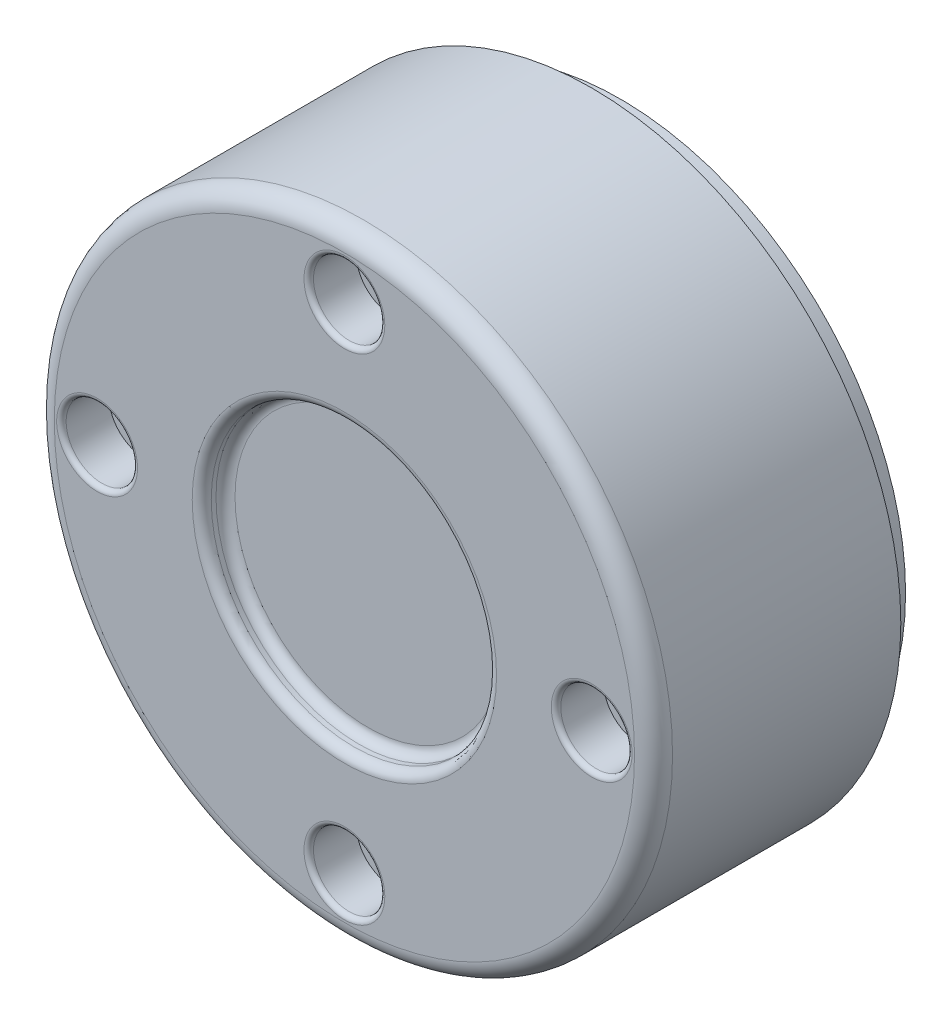
ISO-10303-21;
HEADER;
FILE_DESCRIPTION(('STEP AP214'),'2;1');
FILE_NAME('part.step','',(''),(''),'','','');
FILE_SCHEMA(('AUTOMOTIVE_DESIGN { 1 0 10303 214 1 1 1 1 }'));
ENDSEC;
DATA;
#1=APPLICATION_CONTEXT('core data for automotive mechanical design processes');
#2=APPLICATION_PROTOCOL_DEFINITION('international standard','automotive_design',2000,#1);
#3=PRODUCT_CONTEXT('',#1,'mechanical');
#4=PRODUCT('Part','Part','',(#3));
#5=PRODUCT_RELATED_PRODUCT_CATEGORY('part','',(#4));
#6=PRODUCT_DEFINITION_FORMATION('','',#4);
#7=PRODUCT_DEFINITION_CONTEXT('part definition',#1,'design');
#8=PRODUCT_DEFINITION('design','',#6,#7);
#9=PRODUCT_DEFINITION_SHAPE('','',#8);
#10=(LENGTH_UNIT() NAMED_UNIT(*) SI_UNIT(.MILLI.,.METRE.));
#11=(NAMED_UNIT(*) PLANE_ANGLE_UNIT() SI_UNIT($,.RADIAN.));
#12=(NAMED_UNIT(*) SI_UNIT($,.STERADIAN.) SOLID_ANGLE_UNIT());
#13=UNCERTAINTY_MEASURE_WITH_UNIT(LENGTH_MEASURE(1.E-05),#10,'distance_accuracy_value','');
#14=(GEOMETRIC_REPRESENTATION_CONTEXT(3) GLOBAL_UNCERTAINTY_ASSIGNED_CONTEXT((#13)) GLOBAL_UNIT_ASSIGNED_CONTEXT((#10,
#11,#12)) REPRESENTATION_CONTEXT('',''));
#15=CARTESIAN_POINT('',(0.,0.,0.));
#16=DIRECTION('',(0.,0.,1.));
#17=DIRECTION('',(1.,0.,0.));
#18=AXIS2_PLACEMENT_3D('',#15,#16,#17);
#19=CARTESIAN_POINT('',(0.,0.,3.));
#20=DIRECTION('',(0.,0.,-1.));
#21=DIRECTION('',(-1.,0.,0.));
#22=AXIS2_PLACEMENT_3D('',#19,#20,#21);
#23=CYLINDRICAL_SURFACE('',#22,30.);
#24=CARTESIAN_POINT('',(0.,0.,3.));
#25=DIRECTION('',(0.,0.,1.));
#26=DIRECTION('',(1.,0.,0.));
#27=AXIS2_PLACEMENT_3D('',#24,#25,#26);
#28=CIRCLE('',#27,30.);
#29=CARTESIAN_POINT('',(30.,0.,3.));
#30=VERTEX_POINT('',#29);
#31=EDGE_CURVE('E178',#30,#30,#28,.T.);
#32=ORIENTED_EDGE('',*,*,#31,.F.);
#33=EDGE_LOOP('',(#32));
#34=FACE_BOUND('',#33,.T.);
#35=CARTESIAN_POINT('',(0.,0.,0.));
#36=DIRECTION('',(0.,0.,1.));
#37=DIRECTION('',(1.,0.,0.));
#38=AXIS2_PLACEMENT_3D('',#35,#36,#37);
#39=CIRCLE('',#38,30.);
#40=CARTESIAN_POINT('',(30.,0.,0.));
#41=VERTEX_POINT('',#40);
#42=EDGE_CURVE('E177',#41,#41,#39,.T.);
#43=ORIENTED_EDGE('',*,*,#42,.T.);
#44=EDGE_LOOP('',(#43));
#45=FACE_BOUND('',#44,.T.);
#46=ADVANCED_FACE('F43',(#34,#45),#23,.T.);
#47=CARTESIAN_POINT('',(0.,0.,0.));
#48=DIRECTION('',(0.,0.,1.));
#49=DIRECTION('',(1.,0.,0.));
#50=AXIS2_PLACEMENT_3D('',#47,#48,#49);
#51=PLANE('',#50);
#52=CARTESIAN_POINT('',(0.,0.,0.));
#53=DIRECTION('',(0.,0.,1.));
#54=DIRECTION('',(1.,0.,0.));
#55=AXIS2_PLACEMENT_3D('',#52,#53,#54);
#56=CIRCLE('',#55,27.5);
#57=CARTESIAN_POINT('',(27.5,0.,0.));
#58=VERTEX_POINT('',#57);
#59=EDGE_CURVE('E617',#58,#58,#56,.T.);
#60=ORIENTED_EDGE('',*,*,#59,.T.);
#61=EDGE_LOOP('',(#60));
#62=FACE_BOUND('',#61,.T.);
#63=ORIENTED_EDGE('',*,*,#42,.F.);
#64=EDGE_LOOP('',(#63));
#65=FACE_BOUND('',#64,.T.);
#66=ADVANCED_FACE('F253',(#62,#65),#51,.F.);
#67=CARTESIAN_POINT('',(0.,0.,29.));
#68=DIRECTION('',(0.,0.,-1.));
#69=DIRECTION('',(-1.,0.,0.));
#70=AXIS2_PLACEMENT_3D('',#67,#68,#69);
#71=CYLINDRICAL_SURFACE('',#70,32.5);
#72=CARTESIAN_POINT('',(0.,0.,27.));
#73=DIRECTION('',(0.,0.,1.));
#74=DIRECTION('',(1.,0.,0.));
#75=AXIS2_PLACEMENT_3D('',#72,#73,#74);
#76=CIRCLE('',#75,32.5);
#77=CARTESIAN_POINT('',(-32.5,0.,27.));
#78=VERTEX_POINT('',#77);
#79=EDGE_CURVE('E205',#78,#78,#76,.F.);
#80=CARTESIAN_POINT('',(0.,0.,3.));
#81=DIRECTION('',(0.,0.,1.));
#82=DIRECTION('',(1.,0.,0.));
#83=AXIS2_PLACEMENT_3D('',#80,#81,#82);
#84=CIRCLE('',#83,32.5);
#85=CARTESIAN_POINT('',(-32.5,0.,3.));
#86=VERTEX_POINT('',#85);
#87=EDGE_CURVE('E173',#86,#86,#84,.T.);
#88=CARTESIAN_POINT('',(-32.5,0.,27.));
#89=CARTESIAN_POINT('',(-32.5,0.,26.75));
#90=CARTESIAN_POINT('',(-32.5,0.,26.5));
#91=CARTESIAN_POINT('',(-32.5,0.,26.));
#92=CARTESIAN_POINT('',(-32.5,0.,25.75));
#93=CARTESIAN_POINT('',(-32.5,0.,25.25));
#94=CARTESIAN_POINT('',(-32.5,0.,25.));
#95=CARTESIAN_POINT('',(-32.5,0.,24.5));
#96=CARTESIAN_POINT('',(-32.5,0.,24.25));
#97=CARTESIAN_POINT('',(-32.5,0.,23.75));
#98=CARTESIAN_POINT('',(-32.5,0.,23.5));
#99=CARTESIAN_POINT('',(-32.5,0.,23.));
#100=CARTESIAN_POINT('',(-32.5,0.,22.75));
#101=CARTESIAN_POINT('',(-32.5,0.,22.25));
#102=CARTESIAN_POINT('',(-32.5,0.,22.));
#103=CARTESIAN_POINT('',(-32.5,0.,21.5));
#104=CARTESIAN_POINT('',(-32.5,0.,21.25));
#105=CARTESIAN_POINT('',(-32.5,0.,20.75));
#106=CARTESIAN_POINT('',(-32.5,0.,20.5));
#107=CARTESIAN_POINT('',(-32.5,0.,20.));
#108=CARTESIAN_POINT('',(-32.5,0.,19.75));
#109=CARTESIAN_POINT('',(-32.5,0.,19.25));
#110=CARTESIAN_POINT('',(-32.5,0.,19.));
#111=CARTESIAN_POINT('',(-32.5,0.,18.5));
#112=CARTESIAN_POINT('',(-32.5,0.,18.25));
#113=CARTESIAN_POINT('',(-32.5,0.,17.75));
#114=CARTESIAN_POINT('',(-32.5,0.,17.5));
#115=CARTESIAN_POINT('',(-32.5,0.,17.));
#116=CARTESIAN_POINT('',(-32.5,0.,16.75));
#117=CARTESIAN_POINT('',(-32.5,0.,16.25));
#118=CARTESIAN_POINT('',(-32.5,0.,16.));
#119=CARTESIAN_POINT('',(-32.5,0.,15.5));
#120=CARTESIAN_POINT('',(-32.5,0.,15.25));
#121=CARTESIAN_POINT('',(-32.5,0.,14.75));
#122=CARTESIAN_POINT('',(-32.5,0.,14.5));
#123=CARTESIAN_POINT('',(-32.5,0.,14.));
#124=CARTESIAN_POINT('',(-32.5,0.,13.75));
#125=CARTESIAN_POINT('',(-32.5,0.,13.25));
#126=CARTESIAN_POINT('',(-32.5,0.,13.));
#127=CARTESIAN_POINT('',(-32.5,0.,12.5));
#128=CARTESIAN_POINT('',(-32.5,0.,12.25));
#129=CARTESIAN_POINT('',(-32.5,0.,11.75));
#130=CARTESIAN_POINT('',(-32.5,0.,11.5));
#131=CARTESIAN_POINT('',(-32.5,0.,11.));
#132=CARTESIAN_POINT('',(-32.5,0.,10.75));
#133=CARTESIAN_POINT('',(-32.5,0.,10.25));
#134=CARTESIAN_POINT('',(-32.5,0.,10.));
#135=CARTESIAN_POINT('',(-32.5,0.,9.5));
#136=CARTESIAN_POINT('',(-32.5,0.,9.25));
#137=CARTESIAN_POINT('',(-32.5,0.,8.75));
#138=CARTESIAN_POINT('',(-32.5,0.,8.5));
#139=CARTESIAN_POINT('',(-32.5,0.,8.));
#140=CARTESIAN_POINT('',(-32.5,0.,7.75));
#141=CARTESIAN_POINT('',(-32.5,0.,7.25));
#142=CARTESIAN_POINT('',(-32.5,0.,7.));
#143=CARTESIAN_POINT('',(-32.5,0.,6.5));
#144=CARTESIAN_POINT('',(-32.5,0.,6.25));
#145=CARTESIAN_POINT('',(-32.5,0.,5.75));
#146=CARTESIAN_POINT('',(-32.5,0.,5.5));
#147=CARTESIAN_POINT('',(-32.5,0.,5.));
#148=CARTESIAN_POINT('',(-32.5,0.,4.75));
#149=CARTESIAN_POINT('',(-32.5,0.,4.25));
#150=CARTESIAN_POINT('',(-32.5,0.,4.));
#151=CARTESIAN_POINT('',(-32.5,0.,3.5));
#152=CARTESIAN_POINT('',(-32.5,0.,3.25));
#153=CARTESIAN_POINT('',(-32.5,0.,3.));
#154=B_SPLINE_CURVE_WITH_KNOTS('',3,(#88,#89,#90,#91,#92,#93,#94,#95,#96,#97,#98,#99,#100,#101,
#102,#103,#104,#105,#106,#107,#108,#109,#110,#111,#112,#113,#114,#115,#116,#117,#118,#119,#120,
#121,#122,#123,#124,#125,#126,#127,#128,#129,#130,#131,#132,#133,#134,#135,#136,#137,#138,#139,
#140,#141,#142,#143,#144,#145,#146,#147,#148,#149,#150,#151,#152,#153),.UNSPECIFIED.,.F.,.F.,(4,
2,2,2,2,2,2,2,2,2,2,2,2,2,2,2,2,2,2,2,2,2,2,2,2,2,2,2,2,2,2,2,4),(0.,0.749999999999997,1.5,2.25,
3.,3.75,4.5,5.25,5.99999999999999,6.75,7.5,8.25,9.,9.75,10.5,11.25,12.,12.75,13.5,14.25,15.,
15.75,16.5,17.25,18.,18.75,19.5,20.25,21.,21.75,22.5,23.25,24.),.UNSPECIFIED.);
#155=EDGE_CURVE('BSEAM259',#78,#86,#154,.T.);
#156=ORIENTED_EDGE('',*,*,#79,.T.);
#157=ORIENTED_EDGE('',*,*,#87,.T.);
#158=ORIENTED_EDGE('',*,*,#155,.T.);
#159=ORIENTED_EDGE('',*,*,#155,.F.);
#160=EDGE_LOOP('',(#156,#158,#157,#159));
#161=FACE_BOUND('',#160,.T.);
#162=ADVANCED_FACE('F259',(#161),#71,.T.);
#163=CARTESIAN_POINT('',(0.,0.,29.));
#164=DIRECTION('',(0.,0.,1.));
#165=DIRECTION('',(1.,0.,0.));
#166=AXIS2_PLACEMENT_3D('',#163,#164,#165);
#167=PLANE('',#166);
#168=CARTESIAN_POINT('',(26.,0.,29.));
#169=DIRECTION('',(0.,0.,1.));
#170=DIRECTION('',(1.,0.,0.));
#171=AXIS2_PLACEMENT_3D('',#168,#169,#170);
#172=CIRCLE('',#171,4.25);
#173=CARTESIAN_POINT('',(30.25,0.,29.));
#174=VERTEX_POINT('',#173);
#175=EDGE_CURVE('E225',#174,#174,#172,.F.);
#176=ORIENTED_EDGE('',*,*,#175,.T.);
#177=EDGE_LOOP('',(#176));
#178=FACE_BOUND('',#177,.T.);
#179=CARTESIAN_POINT('',(0.,26.,29.));
#180=DIRECTION('',(0.,0.,1.));
#181=DIRECTION('',(1.,0.,0.));
#182=AXIS2_PLACEMENT_3D('',#179,#180,#181);
#183=CIRCLE('',#182,4.25);
#184=CARTESIAN_POINT('',(4.25,26.,29.));
#185=VERTEX_POINT('',#184);
#186=EDGE_CURVE('E221',#185,#185,#183,.F.);
#187=ORIENTED_EDGE('',*,*,#186,.T.);
#188=EDGE_LOOP('',(#187));
#189=FACE_BOUND('',#188,.T.);
#190=CARTESIAN_POINT('',(-26.,0.,29.));
#191=DIRECTION('',(0.,0.,1.));
#192=DIRECTION('',(1.,0.,0.));
#193=AXIS2_PLACEMENT_3D('',#190,#191,#192);
#194=CIRCLE('',#193,4.25);
#195=CARTESIAN_POINT('',(-21.75,0.,29.));
#196=VERTEX_POINT('',#195);
#197=EDGE_CURVE('E217',#196,#196,#194,.F.);
#198=ORIENTED_EDGE('',*,*,#197,.T.);
#199=EDGE_LOOP('',(#198));
#200=FACE_BOUND('',#199,.T.);
#201=CARTESIAN_POINT('',(0.,-26.,29.));
#202=DIRECTION('',(0.,0.,1.));
#203=DIRECTION('',(1.,0.,0.));
#204=AXIS2_PLACEMENT_3D('',#201,#202,#203);
#205=CIRCLE('',#204,4.25000000000001);
#206=CARTESIAN_POINT('',(4.25000000000001,-26.,29.));
#207=VERTEX_POINT('',#206);
#208=EDGE_CURVE('E213',#207,#207,#205,.F.);
#209=ORIENTED_EDGE('',*,*,#208,.T.);
#210=EDGE_LOOP('',(#209));
#211=FACE_BOUND('',#210,.T.);
#212=CARTESIAN_POINT('',(0.,0.,29.));
#213=DIRECTION('',(0.,0.,1.));
#214=DIRECTION('',(1.,0.,0.));
#215=AXIS2_PLACEMENT_3D('',#212,#213,#214);
#216=CIRCLE('',#215,30.5);
#217=CARTESIAN_POINT('',(30.5,0.,29.));
#218=VERTEX_POINT('',#217);
#219=EDGE_CURVE('E201',#218,#218,#216,.T.);
#220=ORIENTED_EDGE('',*,*,#219,.T.);
#221=EDGE_LOOP('',(#220));
#222=FACE_BOUND('',#221,.T.);
#223=CARTESIAN_POINT('',(0.,0.,29.));
#224=DIRECTION('',(0.,0.,1.));
#225=DIRECTION('',(1.,0.,0.));
#226=AXIS2_PLACEMENT_3D('',#223,#224,#225);
#227=CIRCLE('',#226,16.);
#228=CARTESIAN_POINT('',(16.,0.,29.));
#229=VERTEX_POINT('',#228);
#230=EDGE_CURVE('E197',#229,#229,#227,.F.);
#231=ORIENTED_EDGE('',*,*,#230,.T.);
#232=EDGE_LOOP('',(#231));
#233=FACE_BOUND('',#232,.T.);
#234=ADVANCED_FACE('F327',(#178,#189,#200,#211,#222,#233),#167,.T.);
#235=CARTESIAN_POINT('',(0.,0.,3.));
#236=DIRECTION('',(0.,0.,1.));
#237=DIRECTION('',(1.,0.,0.));
#238=AXIS2_PLACEMENT_3D('',#235,#236,#237);
#239=PLANE('',#238);
#240=ORIENTED_EDGE('',*,*,#31,.T.);
#241=EDGE_LOOP('',(#240));
#242=FACE_BOUND('',#241,.T.);
#243=ORIENTED_EDGE('',*,*,#87,.F.);
#244=EDGE_LOOP('',(#243));
#245=FACE_BOUND('',#244,.T.);
#246=ADVANCED_FACE('F325',(#242,#245),#239,.F.);
#247=CARTESIAN_POINT('',(0.,0.,26.5));
#248=DIRECTION('',(0.,0.,1.));
#249=DIRECTION('',(1.,0.,0.));
#250=AXIS2_PLACEMENT_3D('',#247,#248,#249);
#251=CYLINDRICAL_SURFACE('',#250,15.);
#252=CARTESIAN_POINT('',(0.,0.,28.));
#253=DIRECTION('',(0.,0.,1.));
#254=DIRECTION('',(1.,0.,0.));
#255=AXIS2_PLACEMENT_3D('',#252,#253,#254);
#256=CIRCLE('',#255,15.);
#257=CARTESIAN_POINT('',(15.,0.,28.));
#258=VERTEX_POINT('',#257);
#259=EDGE_CURVE('E193',#258,#258,#256,.T.);
#260=ORIENTED_EDGE('',*,*,#259,.T.);
#261=EDGE_LOOP('',(#260));
#262=FACE_BOUND('',#261,.T.);
#263=CARTESIAN_POINT('',(0.,0.,27.5));
#264=DIRECTION('',(0.,0.,1.));
#265=DIRECTION('',(1.,0.,0.));
#266=AXIS2_PLACEMENT_3D('',#263,#264,#265);
#267=CIRCLE('',#266,15.);
#268=CARTESIAN_POINT('',(15.,0.,27.5));
#269=VERTEX_POINT('',#268);
#270=EDGE_CURVE('E189',#269,#269,#267,.F.);
#271=ORIENTED_EDGE('',*,*,#270,.T.);
#272=EDGE_LOOP('',(#271));
#273=FACE_BOUND('',#272,.T.);
#274=ADVANCED_FACE('F321',(#262,#273),#251,.F.);
#275=CARTESIAN_POINT('',(0.,0.,26.5));
#276=DIRECTION('',(0.,0.,1.));
#277=DIRECTION('',(1.,0.,0.));
#278=AXIS2_PLACEMENT_3D('',#275,#276,#277);
#279=PLANE('',#278);
#280=CARTESIAN_POINT('',(0.,0.,26.5));
#281=DIRECTION('',(0.,0.,1.));
#282=DIRECTION('',(1.,0.,0.));
#283=AXIS2_PLACEMENT_3D('',#280,#281,#282);
#284=CIRCLE('',#283,14.);
#285=CARTESIAN_POINT('',(14.,0.,26.5));
#286=VERTEX_POINT('',#285);
#287=EDGE_CURVE('E182',#286,#286,#284,.T.);
#288=ORIENTED_EDGE('',*,*,#287,.T.);
#289=EDGE_LOOP('',(#288));
#290=FACE_BOUND('',#289,.T.);
#291=ADVANCED_FACE('F318',(#290),#279,.T.);
#292=CARTESIAN_POINT('',(-26.,0.,24.));
#293=DIRECTION('',(0.,0.,1.));
#294=DIRECTION('',(1.,0.,0.));
#295=AXIS2_PLACEMENT_3D('',#292,#293,#294);
#296=CYLINDRICAL_SURFACE('',#295,3.75);
#297=CARTESIAN_POINT('',(-26.,0.,28.5));
#298=DIRECTION('',(0.,0.,1.));
#299=DIRECTION('',(1.,0.,0.));
#300=AXIS2_PLACEMENT_3D('',#297,#298,#299);
#301=CIRCLE('',#300,3.75);
#302=CARTESIAN_POINT('',(-22.25,0.,28.5));
#303=VERTEX_POINT('',#302);
#304=EDGE_CURVE('E52',#303,#303,#301,.T.);
#305=ORIENTED_EDGE('',*,*,#304,.T.);
#306=EDGE_LOOP('',(#305));
#307=FACE_BOUND('',#306,.T.);
#308=CARTESIAN_POINT('',(-26.,0.,24.));
#309=DIRECTION('',(0.,0.,1.));
#310=DIRECTION('',(1.,0.,0.));
#311=AXIS2_PLACEMENT_3D('',#308,#309,#310);
#312=CIRCLE('',#311,3.75);
#313=CARTESIAN_POINT('',(-22.25,0.,24.));
#314=VERTEX_POINT('',#313);
#315=EDGE_CURVE('E161',#314,#314,#312,.T.);
#316=ORIENTED_EDGE('',*,*,#315,.F.);
#317=EDGE_LOOP('',(#316));
#318=FACE_BOUND('',#317,.T.);
#319=ADVANCED_FACE('F236',(#307,#318),#296,.F.);
#320=CARTESIAN_POINT('',(0.,0.,24.));
#321=DIRECTION('',(0.,0.,1.));
#322=DIRECTION('',(1.,0.,0.));
#323=AXIS2_PLACEMENT_3D('',#320,#321,#322);
#324=PLANE('',#323);
#325=ORIENTED_EDGE('',*,*,#315,.T.);
#326=EDGE_LOOP('',(#325));
#327=FACE_BOUND('',#326,.T.);
#328=ADVANCED_FACE('F308',(#327),#324,.T.);
#329=CARTESIAN_POINT('',(0.,-26.,24.));
#330=DIRECTION('',(0.,0.,1.));
#331=DIRECTION('',(1.,0.,0.));
#332=AXIS2_PLACEMENT_3D('',#329,#330,#331);
#333=CYLINDRICAL_SURFACE('',#332,3.75000000000001);
#334=CARTESIAN_POINT('',(0.,-26.,28.5));
#335=DIRECTION('',(0.,0.,1.));
#336=DIRECTION('',(1.,0.,0.));
#337=AXIS2_PLACEMENT_3D('',#334,#335,#336);
#338=CIRCLE('',#337,3.75000000000001);
#339=CARTESIAN_POINT('',(3.75000000000001,-26.,28.5));
#340=VERTEX_POINT('',#339);
#341=EDGE_CURVE('E13',#340,#340,#338,.T.);
#342=ORIENTED_EDGE('',*,*,#341,.T.);
#343=EDGE_LOOP('',(#342));
#344=FACE_BOUND('',#343,.T.);
#345=CARTESIAN_POINT('',(0.,-26.,24.));
#346=DIRECTION('',(0.,0.,1.));
#347=DIRECTION('',(1.,0.,0.));
#348=AXIS2_PLACEMENT_3D('',#345,#346,#347);
#349=CIRCLE('',#348,3.75000000000001);
#350=CARTESIAN_POINT('',(3.75000000000001,-26.,24.));
#351=VERTEX_POINT('',#350);
#352=EDGE_CURVE('E166',#351,#351,#349,.T.);
#353=ORIENTED_EDGE('',*,*,#352,.F.);
#354=EDGE_LOOP('',(#353));
#355=FACE_BOUND('',#354,.T.);
#356=ADVANCED_FACE('F305',(#344,#355),#333,.F.);
#357=CARTESIAN_POINT('',(0.,-26.,24.));
#358=DIRECTION('',(0.,0.,1.));
#359=DIRECTION('',(1.,0.,0.));
#360=AXIS2_PLACEMENT_3D('',#357,#358,#359);
#361=PLANE('',#360);
#362=ORIENTED_EDGE('',*,*,#352,.T.);
#363=EDGE_LOOP('',(#362));
#364=FACE_BOUND('',#363,.T.);
#365=ADVANCED_FACE('F291',(#364),#361,.T.);
#366=CARTESIAN_POINT('',(26.,0.,24.));
#367=DIRECTION('',(0.,0.,1.));
#368=DIRECTION('',(1.,0.,0.));
#369=AXIS2_PLACEMENT_3D('',#366,#367,#368);
#370=CYLINDRICAL_SURFACE('',#369,3.75);
#371=CARTESIAN_POINT('',(26.,0.,28.5));
#372=DIRECTION('',(0.,0.,1.));
#373=DIRECTION('',(1.,0.,0.));
#374=AXIS2_PLACEMENT_3D('',#371,#372,#373);
#375=CIRCLE('',#374,3.75);
#376=CARTESIAN_POINT('',(29.75,0.,28.5));
#377=VERTEX_POINT('',#376);
#378=EDGE_CURVE('E209',#377,#377,#375,.T.);
#379=ORIENTED_EDGE('',*,*,#378,.T.);
#380=EDGE_LOOP('',(#379));
#381=FACE_BOUND('',#380,.T.);
#382=CARTESIAN_POINT('',(26.,0.,24.));
#383=DIRECTION('',(0.,0.,1.));
#384=DIRECTION('',(1.,0.,0.));
#385=AXIS2_PLACEMENT_3D('',#382,#383,#384);
#386=CIRCLE('',#385,3.75);
#387=CARTESIAN_POINT('',(29.75,0.,24.));
#388=VERTEX_POINT('',#387);
#389=EDGE_CURVE('E162',#388,#388,#386,.T.);
#390=ORIENTED_EDGE('',*,*,#389,.F.);
#391=EDGE_LOOP('',(#390));
#392=FACE_BOUND('',#391,.T.);
#393=ADVANCED_FACE('F287',(#381,#392),#370,.F.);
#394=CARTESIAN_POINT('',(0.,0.,24.));
#395=DIRECTION('',(0.,0.,1.));
#396=DIRECTION('',(1.,0.,0.));
#397=AXIS2_PLACEMENT_3D('',#394,#395,#396);
#398=PLANE('',#397);
#399=ORIENTED_EDGE('',*,*,#389,.T.);
#400=EDGE_LOOP('',(#399));
#401=FACE_BOUND('',#400,.T.);
#402=ADVANCED_FACE('F290',(#401),#398,.T.);
#403=CARTESIAN_POINT('',(0.,26.,24.));
#404=DIRECTION('',(0.,0.,1.));
#405=DIRECTION('',(1.,0.,0.));
#406=AXIS2_PLACEMENT_3D('',#403,#404,#405);
#407=CYLINDRICAL_SURFACE('',#406,3.75);
#408=CARTESIAN_POINT('',(0.,26.,28.5));
#409=DIRECTION('',(0.,0.,1.));
#410=DIRECTION('',(1.,0.,0.));
#411=AXIS2_PLACEMENT_3D('',#408,#409,#410);
#412=CIRCLE('',#411,3.75);
#413=CARTESIAN_POINT('',(3.75,26.,28.5));
#414=VERTEX_POINT('',#413);
#415=EDGE_CURVE('E229',#414,#414,#412,.T.);
#416=ORIENTED_EDGE('',*,*,#415,.T.);
#417=EDGE_LOOP('',(#416));
#418=FACE_BOUND('',#417,.T.);
#419=CARTESIAN_POINT('',(0.,26.,24.));
#420=DIRECTION('',(0.,0.,1.));
#421=DIRECTION('',(1.,0.,0.));
#422=AXIS2_PLACEMENT_3D('',#419,#420,#421);
#423=CIRCLE('',#422,3.75);
#424=CARTESIAN_POINT('',(3.75,26.,24.));
#425=VERTEX_POINT('',#424);
#426=EDGE_CURVE('E157',#425,#425,#423,.T.);
#427=ORIENTED_EDGE('',*,*,#426,.F.);
#428=EDGE_LOOP('',(#427));
#429=FACE_BOUND('',#428,.T.);
#430=ADVANCED_FACE('F296',(#418,#429),#407,.F.);
#431=CARTESIAN_POINT('',(0.,0.,24.));
#432=DIRECTION('',(0.,0.,1.));
#433=DIRECTION('',(1.,0.,0.));
#434=AXIS2_PLACEMENT_3D('',#431,#432,#433);
#435=PLANE('',#434);
#436=ORIENTED_EDGE('',*,*,#426,.T.);
#437=EDGE_LOOP('',(#436));
#438=FACE_BOUND('',#437,.T.);
#439=ADVANCED_FACE('F270',(#438),#435,.T.);
#440=CARTESIAN_POINT('',(0.,0.,27.5));
#441=DIRECTION('',(0.,0.,1.));
#442=DIRECTION('',(1.,0.,0.));
#443=AXIS2_PLACEMENT_3D('',#440,#441,#442);
#444=TOROIDAL_SURFACE('',#443,14.,1.);
#445=ORIENTED_EDGE('',*,*,#270,.F.);
#446=EDGE_LOOP('',(#445));
#447=FACE_BOUND('',#446,.T.);
#448=ORIENTED_EDGE('',*,*,#287,.F.);
#449=EDGE_LOOP('',(#448));
#450=FACE_BOUND('',#449,.T.);
#451=ADVANCED_FACE('F266',(#447,#450),#444,.F.);
#452=CARTESIAN_POINT('',(0.,0.,28.));
#453=DIRECTION('',(0.,0.,1.));
#454=DIRECTION('',(1.,0.,0.));
#455=AXIS2_PLACEMENT_3D('',#452,#453,#454);
#456=TOROIDAL_SURFACE('',#455,16.,1.);
#457=ORIENTED_EDGE('',*,*,#230,.F.);
#458=EDGE_LOOP('',(#457));
#459=FACE_BOUND('',#458,.T.);
#460=ORIENTED_EDGE('',*,*,#259,.F.);
#461=EDGE_LOOP('',(#460));
#462=FACE_BOUND('',#461,.T.);
#463=ADVANCED_FACE('F269',(#459,#462),#456,.T.);
#464=CARTESIAN_POINT('',(0.,0.,27.));
#465=DIRECTION('',(0.,0.,1.));
#466=DIRECTION('',(1.,0.,0.));
#467=AXIS2_PLACEMENT_3D('',#464,#465,#466);
#468=TOROIDAL_SURFACE('',#467,30.5,2.);
#469=ORIENTED_EDGE('',*,*,#79,.F.);
#470=EDGE_LOOP('',(#469));
#471=FACE_BOUND('',#470,.T.);
#472=ORIENTED_EDGE('',*,*,#219,.F.);
#473=EDGE_LOOP('',(#472));
#474=FACE_BOUND('',#473,.T.);
#475=ADVANCED_FACE('F274',(#471,#474),#468,.T.);
#476=CARTESIAN_POINT('',(26.,0.,28.5));
#477=DIRECTION('',(0.,0.,1.));
#478=DIRECTION('',(1.,0.,0.));
#479=AXIS2_PLACEMENT_3D('',#476,#477,#478);
#480=TOROIDAL_SURFACE('',#479,4.25,0.5);
#481=ORIENTED_EDGE('',*,*,#175,.F.);
#482=EDGE_LOOP('',(#481));
#483=FACE_BOUND('',#482,.T.);
#484=ORIENTED_EDGE('',*,*,#378,.F.);
#485=EDGE_LOOP('',(#484));
#486=FACE_BOUND('',#485,.T.);
#487=ADVANCED_FACE('F248',(#483,#486),#480,.T.);
#488=CARTESIAN_POINT('',(0.,26.,28.5));
#489=DIRECTION('',(0.,0.,1.));
#490=DIRECTION('',(1.,0.,0.));
#491=AXIS2_PLACEMENT_3D('',#488,#489,#490);
#492=TOROIDAL_SURFACE('',#491,4.25,0.5);
#493=ORIENTED_EDGE('',*,*,#186,.F.);
#494=EDGE_LOOP('',(#493));
#495=FACE_BOUND('',#494,.T.);
#496=ORIENTED_EDGE('',*,*,#415,.F.);
#497=EDGE_LOOP('',(#496));
#498=FACE_BOUND('',#497,.T.);
#499=ADVANCED_FACE('F241',(#495,#498),#492,.T.);
#500=CARTESIAN_POINT('',(-26.,0.,28.5));
#501=DIRECTION('',(0.,0.,1.));
#502=DIRECTION('',(1.,0.,0.));
#503=AXIS2_PLACEMENT_3D('',#500,#501,#502);
#504=TOROIDAL_SURFACE('',#503,4.25,0.5);
#505=ORIENTED_EDGE('',*,*,#197,.F.);
#506=EDGE_LOOP('',(#505));
#507=FACE_BOUND('',#506,.T.);
#508=ORIENTED_EDGE('',*,*,#304,.F.);
#509=EDGE_LOOP('',(#508));
#510=FACE_BOUND('',#509,.T.);
#511=ADVANCED_FACE('F239',(#507,#510),#504,.T.);
#512=CARTESIAN_POINT('',(0.,-26.,28.5));
#513=DIRECTION('',(0.,0.,1.));
#514=DIRECTION('',(1.,0.,0.));
#515=AXIS2_PLACEMENT_3D('',#512,#513,#514);
#516=TOROIDAL_SURFACE('',#515,4.25000000000001,0.5);
#517=ORIENTED_EDGE('',*,*,#208,.F.);
#518=EDGE_LOOP('',(#517));
#519=FACE_BOUND('',#518,.T.);
#520=ORIENTED_EDGE('',*,*,#341,.F.);
#521=EDGE_LOOP('',(#520));
#522=FACE_BOUND('',#521,.T.);
#523=ADVANCED_FACE('F45',(#519,#522),#516,.T.);
#524=CARTESIAN_POINT('',(0.,0.,29.));
#525=DIRECTION('',(0.,0.,-1.));
#526=DIRECTION('',(-1.,0.,0.));
#527=AXIS2_PLACEMENT_3D('',#524,#525,#526);
#528=CYLINDRICAL_SURFACE('',#527,30.);
#529=CARTESIAN_POINT('',(0.,0.,5.5));
#530=DIRECTION('',(0.,0.,1.));
#531=DIRECTION('',(1.,0.,0.));
#532=AXIS2_PLACEMENT_3D('',#529,#530,#531);
#533=CIRCLE('',#532,30.);
#534=CARTESIAN_POINT('',(30.,0.,5.5));
#535=VERTEX_POINT('',#534);
#536=EDGE_CURVE('E611',#535,#535,#533,.T.);
#537=ORIENTED_EDGE('',*,*,#536,.F.);
#538=EDGE_LOOP('',(#537));
#539=FACE_BOUND('',#538,.T.);
#540=DIRECTION('',(0.,0.,1.));
#541=VECTOR('',#540,1.);
#542=CARTESIAN_POINT('',(29.5564903846154,5.13944317452177,24.));
#543=LINE('',#542,#541);
#544=CARTESIAN_POINT('',(29.5564903846154,5.13944317452176,26.5));
#545=VERTEX_POINT('',#544);
#546=CARTESIAN_POINT('',(29.5564903846154,5.13944317452177,21.5));
#547=VERTEX_POINT('',#546);
#548=EDGE_CURVE('E105',#545,#547,#543,.F.);
#549=ORIENTED_EDGE('',*,*,#548,.F.);
#550=CARTESIAN_POINT('',(0.,0.,26.5));
#551=DIRECTION('',(0.,0.,1.));
#552=DIRECTION('',(1.,0.,0.));
#553=AXIS2_PLACEMENT_3D('',#550,#551,#552);
#554=CIRCLE('',#553,30.);
#555=CARTESIAN_POINT('',(5.13944317452176,29.5564903846154,26.5));
#556=VERTEX_POINT('',#555);
#557=EDGE_CURVE('E110',#545,#556,#554,.T.);
#558=ORIENTED_EDGE('',*,*,#557,.T.);
#559=DIRECTION('',(0.,0.,1.));
#560=VECTOR('',#559,1.);
#561=CARTESIAN_POINT('',(5.13944317452176,29.5564903846154,29.));
#562=LINE('',#561,#560);
#563=CARTESIAN_POINT('',(5.13944317452176,29.5564903846154,21.5));
#564=VERTEX_POINT('',#563);
#565=EDGE_CURVE('E599',#556,#564,#562,.F.);
#566=ORIENTED_EDGE('',*,*,#565,.T.);
#567=CARTESIAN_POINT('',(0.,0.,21.5));
#568=DIRECTION('',(0.,0.,1.));
#569=DIRECTION('',(1.,0.,0.));
#570=AXIS2_PLACEMENT_3D('',#567,#568,#569);
#571=CIRCLE('',#570,30.);
#572=CARTESIAN_POINT('',(-5.13944317452177,29.5564903846154,21.5));
#573=VERTEX_POINT('',#572);
#574=EDGE_CURVE('E593',#573,#564,#571,.F.);
#575=ORIENTED_EDGE('',*,*,#574,.F.);
#576=DIRECTION('',(0.,0.,1.));
#577=VECTOR('',#576,1.);
#578=CARTESIAN_POINT('',(-5.13944317452177,29.5564903846154,24.));
#579=LINE('',#578,#577);
#580=CARTESIAN_POINT('',(-5.13944317452176,29.5564903846154,26.5));
#581=VERTEX_POINT('',#580);
#582=EDGE_CURVE('E601',#581,#573,#579,.F.);
#583=ORIENTED_EDGE('',*,*,#582,.F.);
#584=CARTESIAN_POINT('',(-29.5564903846154,5.13944317452175,26.5));
#585=VERTEX_POINT('',#584);
#586=EDGE_CURVE('E133',#581,#585,#554,.T.);
#587=ORIENTED_EDGE('',*,*,#586,.T.);
#588=DIRECTION('',(0.,0.,1.));
#589=VECTOR('',#588,1.);
#590=CARTESIAN_POINT('',(-29.5564903846154,5.13944317452175,29.));
#591=LINE('',#590,#589);
#592=CARTESIAN_POINT('',(-29.5564903846154,5.13944317452175,21.5));
#593=VERTEX_POINT('',#592);
#594=EDGE_CURVE('E629',#585,#593,#591,.F.);
#595=ORIENTED_EDGE('',*,*,#594,.T.);
#596=CARTESIAN_POINT('',(0.,0.,21.5));
#597=DIRECTION('',(0.,0.,1.));
#598=DIRECTION('',(1.,0.,0.));
#599=AXIS2_PLACEMENT_3D('',#596,#597,#598);
#600=CIRCLE('',#599,30.);
#601=CARTESIAN_POINT('',(-29.5564903846154,-5.13944317452178,21.5));
#602=VERTEX_POINT('',#601);
#603=EDGE_CURVE('E598',#602,#593,#600,.F.);
#604=ORIENTED_EDGE('',*,*,#603,.F.);
#605=DIRECTION('',(0.,0.,1.));
#606=VECTOR('',#605,1.);
#607=CARTESIAN_POINT('',(-29.5564903846154,-5.13944317452178,24.));
#608=LINE('',#607,#606);
#609=CARTESIAN_POINT('',(-29.5564903846154,-5.13944317452176,26.5));
#610=VERTEX_POINT('',#609);
#611=EDGE_CURVE('E602',#610,#602,#608,.F.);
#612=ORIENTED_EDGE('',*,*,#611,.F.);
#613=CARTESIAN_POINT('',(-5.13944317452177,-29.5564903846154,26.5));
#614=VERTEX_POINT('',#613);
#615=EDGE_CURVE('E138',#610,#614,#554,.T.);
#616=ORIENTED_EDGE('',*,*,#615,.T.);
#617=DIRECTION('',(0.,0.,1.));
#618=VECTOR('',#617,1.);
#619=CARTESIAN_POINT('',(-5.13944317452177,-29.5564903846154,29.));
#620=LINE('',#619,#618);
#621=CARTESIAN_POINT('',(-5.13944317452177,-29.5564903846154,21.5));
#622=VERTEX_POINT('',#621);
#623=EDGE_CURVE('E621',#614,#622,#620,.F.);
#624=ORIENTED_EDGE('',*,*,#623,.T.);
#625=CARTESIAN_POINT('',(0.,0.,21.5));
#626=DIRECTION('',(0.,0.,1.));
#627=DIRECTION('',(1.,0.,0.));
#628=AXIS2_PLACEMENT_3D('',#625,#626,#627);
#629=CIRCLE('',#628,30.);
#630=CARTESIAN_POINT('',(5.13944317452178,-29.5564903846154,21.5));
#631=VERTEX_POINT('',#630);
#632=EDGE_CURVE('E114',#622,#631,#629,.T.);
#633=ORIENTED_EDGE('',*,*,#632,.T.);
#634=DIRECTION('',(0.,0.,1.));
#635=VECTOR('',#634,1.);
#636=CARTESIAN_POINT('',(5.13944317452178,-29.5564903846154,24.));
#637=LINE('',#636,#635);
#638=CARTESIAN_POINT('',(5.13944317452177,-29.5564903846154,26.5));
#639=VERTEX_POINT('',#638);
#640=EDGE_CURVE('E625',#639,#631,#637,.F.);
#641=ORIENTED_EDGE('',*,*,#640,.F.);
#642=CARTESIAN_POINT('',(29.5564903846154,-5.13944317452176,26.5));
#643=VERTEX_POINT('',#642);
#644=EDGE_CURVE('E135',#639,#643,#554,.T.);
#645=ORIENTED_EDGE('',*,*,#644,.T.);
#646=DIRECTION('',(0.,0.,1.));
#647=VECTOR('',#646,1.);
#648=CARTESIAN_POINT('',(29.5564903846154,-5.13944317452176,29.));
#649=LINE('',#648,#647);
#650=CARTESIAN_POINT('',(29.5564903846154,-5.13944317452176,21.5));
#651=VERTEX_POINT('',#650);
#652=EDGE_CURVE('E115',#643,#651,#649,.F.);
#653=ORIENTED_EDGE('',*,*,#652,.T.);
#654=CARTESIAN_POINT('',(0.,0.,21.5));
#655=DIRECTION('',(0.,0.,1.));
#656=DIRECTION('',(1.,0.,0.));
#657=AXIS2_PLACEMENT_3D('',#654,#655,#656);
#658=CIRCLE('',#657,30.);
#659=EDGE_CURVE('E59',#547,#651,#658,.F.);
#660=ORIENTED_EDGE('',*,*,#659,.F.);
#661=EDGE_LOOP('',(#549,#558,#566,#575,#583,#587,#595,#604,#612,#616,#624,#633,#641,#645,#653,#660));
#662=FACE_BOUND('',#661,.T.);
#663=ADVANCED_FACE('F107',(#539,#662),#528,.F.);
#664=CARTESIAN_POINT('',(0.,0.,3.));
#665=DIRECTION('',(0.,0.,-1.));
#666=DIRECTION('',(-1.,0.,0.));
#667=AXIS2_PLACEMENT_3D('',#664,#665,#666);
#668=CYLINDRICAL_SURFACE('',#667,27.5);
#669=CARTESIAN_POINT('',(0.,0.,5.5));
#670=DIRECTION('',(0.,0.,1.));
#671=DIRECTION('',(1.,0.,0.));
#672=AXIS2_PLACEMENT_3D('',#669,#670,#671);
#673=CIRCLE('',#672,27.5);
#674=CARTESIAN_POINT('',(27.5,0.,5.5));
#675=VERTEX_POINT('',#674);
#676=EDGE_CURVE('E152',#675,#675,#673,.T.);
#677=ORIENTED_EDGE('',*,*,#676,.T.);
#678=EDGE_LOOP('',(#677));
#679=FACE_BOUND('',#678,.T.);
#680=ORIENTED_EDGE('',*,*,#59,.F.);
#681=EDGE_LOOP('',(#680));
#682=FACE_BOUND('',#681,.T.);
#683=ADVANCED_FACE('F439',(#679,#682),#668,.F.);
#684=CARTESIAN_POINT('',(0.,0.,26.5));
#685=DIRECTION('',(0.,0.,1.));
#686=DIRECTION('',(1.,0.,0.));
#687=AXIS2_PLACEMENT_3D('',#684,#685,#686);
#688=PLANE('',#687);
#689=ORIENTED_EDGE('',*,*,#615,.F.);
#690=CARTESIAN_POINT('',(-26.,0.,26.5));
#691=DIRECTION('',(0.,0.,1.));
#692=DIRECTION('',(1.,0.,0.));
#693=AXIS2_PLACEMENT_3D('',#690,#691,#692);
#694=CIRCLE('',#693,6.25);
#695=EDGE_CURVE('E647',#610,#585,#694,.T.);
#696=ORIENTED_EDGE('',*,*,#695,.T.);
#697=ORIENTED_EDGE('',*,*,#586,.F.);
#698=CARTESIAN_POINT('',(0.,26.,26.5));
#699=DIRECTION('',(0.,0.,1.));
#700=DIRECTION('',(1.,0.,0.));
#701=AXIS2_PLACEMENT_3D('',#698,#699,#700);
#702=CIRCLE('',#701,6.25);
#703=EDGE_CURVE('E124',#581,#556,#702,.T.);
#704=ORIENTED_EDGE('',*,*,#703,.T.);
#705=ORIENTED_EDGE('',*,*,#557,.F.);
#706=CARTESIAN_POINT('',(26.,0.,26.5));
#707=DIRECTION('',(0.,0.,1.));
#708=DIRECTION('',(1.,0.,0.));
#709=AXIS2_PLACEMENT_3D('',#706,#707,#708);
#710=CIRCLE('',#709,6.25);
#711=EDGE_CURVE('E118',#545,#643,#710,.T.);
#712=ORIENTED_EDGE('',*,*,#711,.T.);
#713=ORIENTED_EDGE('',*,*,#644,.F.);
#714=CARTESIAN_POINT('',(0.,-26.,26.5));
#715=DIRECTION('',(0.,0.,1.));
#716=DIRECTION('',(1.,0.,0.));
#717=AXIS2_PLACEMENT_3D('',#714,#715,#716);
#718=CIRCLE('',#717,6.25000000000001);
#719=EDGE_CURVE('E626',#639,#614,#718,.T.);
#720=ORIENTED_EDGE('',*,*,#719,.T.);
#721=EDGE_LOOP('',(#689,#696,#697,#704,#705,#712,#713,#720));
#722=FACE_BOUND('',#721,.T.);
#723=CARTESIAN_POINT('',(0.,0.,26.5));
#724=DIRECTION('',(0.,0.,1.));
#725=DIRECTION('',(1.,0.,0.));
#726=AXIS2_PLACEMENT_3D('',#723,#724,#725);
#727=CIRCLE('',#726,17.3541019662497);
#728=CARTESIAN_POINT('',(17.3541019662497,0.,26.5));
#729=VERTEX_POINT('',#728);
#730=EDGE_CURVE('E141',#729,#729,#727,.F.);
#731=ORIENTED_EDGE('',*,*,#730,.F.);
#732=EDGE_LOOP('',(#731));
#733=FACE_BOUND('',#732,.T.);
#734=ADVANCED_FACE('F128',(#722,#733),#688,.F.);
#735=CARTESIAN_POINT('',(0.,0.,5.5));
#736=DIRECTION('',(0.,0.,1.));
#737=DIRECTION('',(1.,0.,0.));
#738=AXIS2_PLACEMENT_3D('',#735,#736,#737);
#739=PLANE('',#738);
#740=ORIENTED_EDGE('',*,*,#676,.F.);
#741=EDGE_LOOP('',(#740));
#742=FACE_BOUND('',#741,.T.);
#743=ORIENTED_EDGE('',*,*,#536,.T.);
#744=EDGE_LOOP('',(#743));
#745=FACE_BOUND('',#744,.T.);
#746=ADVANCED_FACE('F457',(#742,#745),#739,.T.);
#747=CARTESIAN_POINT('',(0.,0.,24.));
#748=DIRECTION('',(0.,0.,1.));
#749=DIRECTION('',(1.,0.,0.));
#750=AXIS2_PLACEMENT_3D('',#747,#748,#749);
#751=PLANE('',#750);
#752=CARTESIAN_POINT('',(0.,0.,24.));
#753=DIRECTION('',(0.,0.,1.));
#754=DIRECTION('',(1.,0.,0.));
#755=AXIS2_PLACEMENT_3D('',#752,#753,#754);
#756=CIRCLE('',#755,14.);
#757=CARTESIAN_POINT('',(14.,0.,24.));
#758=VERTEX_POINT('',#757);
#759=EDGE_CURVE('E146',#758,#758,#756,.T.);
#760=ORIENTED_EDGE('',*,*,#759,.F.);
#761=EDGE_LOOP('',(#760));
#762=FACE_BOUND('',#761,.T.);
#763=ADVANCED_FACE('F466',(#762),#751,.F.);
#764=CARTESIAN_POINT('',(-26.,0.,24.));
#765=DIRECTION('',(0.,0.,1.));
#766=DIRECTION('',(1.,0.,0.));
#767=AXIS2_PLACEMENT_3D('',#764,#765,#766);
#768=CYLINDRICAL_SURFACE('',#767,6.25);
#769=ORIENTED_EDGE('',*,*,#611,.T.);
#770=CARTESIAN_POINT('',(-26.,0.,21.5));
#771=DIRECTION('',(0.,0.,1.));
#772=DIRECTION('',(1.,0.,0.));
#773=AXIS2_PLACEMENT_3D('',#770,#771,#772);
#774=CIRCLE('',#773,6.25);
#775=EDGE_CURVE('E605',#602,#593,#774,.T.);
#776=ORIENTED_EDGE('',*,*,#775,.T.);
#777=ORIENTED_EDGE('',*,*,#594,.F.);
#778=ORIENTED_EDGE('',*,*,#695,.F.);
#779=EDGE_LOOP('',(#769,#776,#777,#778));
#780=FACE_BOUND('',#779,.T.);
#781=ADVANCED_FACE('F476',(#780),#768,.T.);
#782=CARTESIAN_POINT('',(0.,0.,21.5));
#783=DIRECTION('',(0.,0.,1.));
#784=DIRECTION('',(1.,0.,0.));
#785=AXIS2_PLACEMENT_3D('',#782,#783,#784);
#786=PLANE('',#785);
#787=ORIENTED_EDGE('',*,*,#603,.T.);
#788=ORIENTED_EDGE('',*,*,#775,.F.);
#789=EDGE_LOOP('',(#787,#788));
#790=FACE_BOUND('',#789,.T.);
#791=ADVANCED_FACE('F486',(#790),#786,.F.);
#792=CARTESIAN_POINT('',(0.,-26.,24.));
#793=DIRECTION('',(0.,0.,1.));
#794=DIRECTION('',(1.,0.,0.));
#795=AXIS2_PLACEMENT_3D('',#792,#793,#794);
#796=CYLINDRICAL_SURFACE('',#795,6.25000000000001);
#797=ORIENTED_EDGE('',*,*,#640,.T.);
#798=CARTESIAN_POINT('',(0.,-26.,21.5));
#799=DIRECTION('',(0.,0.,1.));
#800=DIRECTION('',(1.,0.,0.));
#801=AXIS2_PLACEMENT_3D('',#798,#799,#800);
#802=CIRCLE('',#801,6.25000000000001);
#803=EDGE_CURVE('E613',#631,#622,#802,.T.);
#804=ORIENTED_EDGE('',*,*,#803,.T.);
#805=ORIENTED_EDGE('',*,*,#623,.F.);
#806=ORIENTED_EDGE('',*,*,#719,.F.);
#807=EDGE_LOOP('',(#797,#804,#805,#806));
#808=FACE_BOUND('',#807,.T.);
#809=ADVANCED_FACE('F496',(#808),#796,.T.);
#810=CARTESIAN_POINT('',(0.,-26.,21.5));
#811=DIRECTION('',(0.,0.,1.));
#812=DIRECTION('',(1.,0.,0.));
#813=AXIS2_PLACEMENT_3D('',#810,#811,#812);
#814=PLANE('',#813);
#815=ORIENTED_EDGE('',*,*,#803,.F.);
#816=ORIENTED_EDGE('',*,*,#632,.F.);
#817=EDGE_LOOP('',(#815,#816));
#818=FACE_BOUND('',#817,.T.);
#819=ADVANCED_FACE('F506',(#818),#814,.F.);
#820=CARTESIAN_POINT('',(26.,0.,24.));
#821=DIRECTION('',(0.,0.,1.));
#822=DIRECTION('',(1.,0.,0.));
#823=AXIS2_PLACEMENT_3D('',#820,#821,#822);
#824=CYLINDRICAL_SURFACE('',#823,6.25);
#825=ORIENTED_EDGE('',*,*,#548,.T.);
#826=CARTESIAN_POINT('',(26.,0.,21.5));
#827=DIRECTION('',(0.,0.,1.));
#828=DIRECTION('',(1.,0.,0.));
#829=AXIS2_PLACEMENT_3D('',#826,#827,#828);
#830=CIRCLE('',#829,6.25);
#831=EDGE_CURVE('E606',#547,#651,#830,.T.);
#832=ORIENTED_EDGE('',*,*,#831,.T.);
#833=ORIENTED_EDGE('',*,*,#652,.F.);
#834=ORIENTED_EDGE('',*,*,#711,.F.);
#835=EDGE_LOOP('',(#825,#832,#833,#834));
#836=FACE_BOUND('',#835,.T.);
#837=ADVANCED_FACE('F119',(#836),#824,.T.);
#838=CARTESIAN_POINT('',(0.,0.,21.5));
#839=DIRECTION('',(0.,0.,1.));
#840=DIRECTION('',(1.,0.,0.));
#841=AXIS2_PLACEMENT_3D('',#838,#839,#840);
#842=PLANE('',#841);
#843=ORIENTED_EDGE('',*,*,#659,.T.);
#844=ORIENTED_EDGE('',*,*,#831,.F.);
#845=EDGE_LOOP('',(#843,#844));
#846=FACE_BOUND('',#845,.T.);
#847=ADVANCED_FACE('F525',(#846),#842,.F.);
#848=CARTESIAN_POINT('',(0.,26.,24.));
#849=DIRECTION('',(0.,0.,1.));
#850=DIRECTION('',(1.,0.,0.));
#851=AXIS2_PLACEMENT_3D('',#848,#849,#850);
#852=CYLINDRICAL_SURFACE('',#851,6.25);
#853=ORIENTED_EDGE('',*,*,#582,.T.);
#854=CARTESIAN_POINT('',(0.,26.,21.5));
#855=DIRECTION('',(0.,0.,1.));
#856=DIRECTION('',(1.,0.,0.));
#857=AXIS2_PLACEMENT_3D('',#854,#855,#856);
#858=CIRCLE('',#857,6.25);
#859=EDGE_CURVE('E595',#573,#564,#858,.T.);
#860=ORIENTED_EDGE('',*,*,#859,.T.);
#861=ORIENTED_EDGE('',*,*,#565,.F.);
#862=ORIENTED_EDGE('',*,*,#703,.F.);
#863=EDGE_LOOP('',(#853,#860,#861,#862));
#864=FACE_BOUND('',#863,.T.);
#865=ADVANCED_FACE('F534',(#864),#852,.T.);
#866=CARTESIAN_POINT('',(0.,0.,21.5));
#867=DIRECTION('',(0.,0.,1.));
#868=DIRECTION('',(1.,0.,0.));
#869=AXIS2_PLACEMENT_3D('',#866,#867,#868);
#870=PLANE('',#869);
#871=ORIENTED_EDGE('',*,*,#574,.T.);
#872=ORIENTED_EDGE('',*,*,#859,.F.);
#873=EDGE_LOOP('',(#871,#872));
#874=FACE_BOUND('',#873,.T.);
#875=ADVANCED_FACE('F543',(#874),#870,.F.);
#876=CARTESIAN_POINT('',(0.,0.,27.5));
#877=DIRECTION('',(0.,0.,1.));
#878=DIRECTION('',(1.,0.,0.));
#879=AXIS2_PLACEMENT_3D('',#876,#877,#878);
#880=TOROIDAL_SURFACE('',#879,14.,3.5);
#881=ORIENTED_EDGE('',*,*,#730,.T.);
#882=EDGE_LOOP('',(#881));
#883=FACE_BOUND('',#882,.T.);
#884=ORIENTED_EDGE('',*,*,#759,.T.);
#885=EDGE_LOOP('',(#884));
#886=FACE_BOUND('',#885,.T.);
#887=ADVANCED_FACE('F553',(#883,#886),#880,.T.);
#888=CLOSED_SHELL('',(#46,#66,#162,#234,#246,#274,#291,#319,#328,#356,#365,#393,#402,#430,#439,
#451,#463,#475,#487,#499,#511,#523,#663,#683,#734,#746,#763,#781,#791,#809,#819,#837,#847,#865,
#875,#887));
#889=MANIFOLD_SOLID_BREP('B2',#888);
#890=ADVANCED_BREP_SHAPE_REPRESENTATION('',(#18,#889),#14);
#891=SHAPE_DEFINITION_REPRESENTATION(#9,#890);
ENDSEC;
END-ISO-10303-21;
